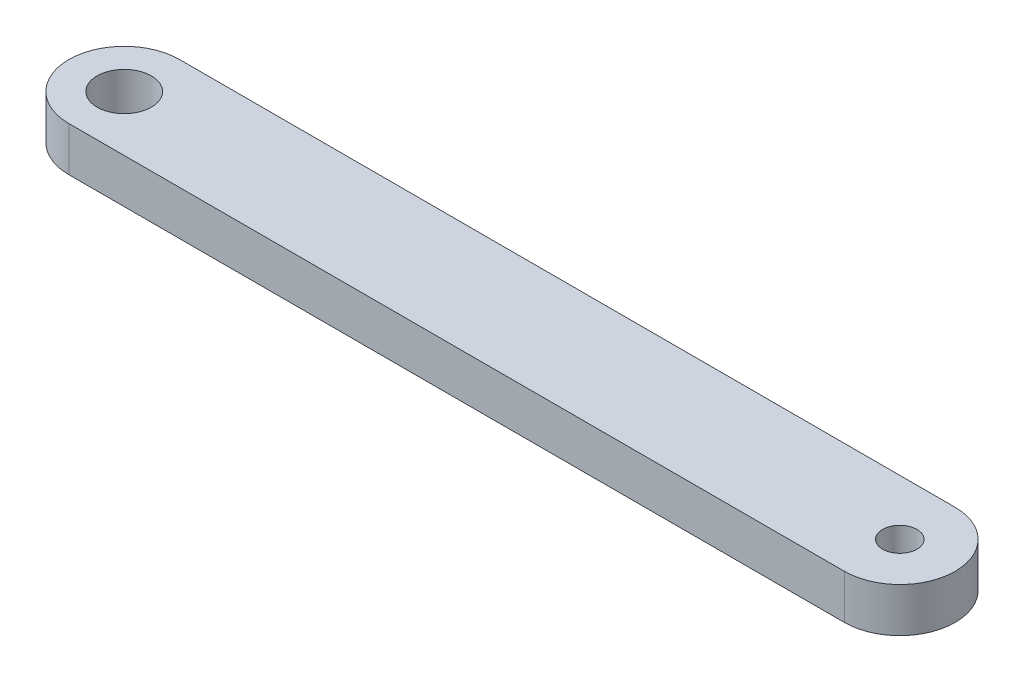
ISO-10303-21;
HEADER;
FILE_DESCRIPTION(('STEP AP214'),'2;1');
FILE_NAME('part.step','',(''),(''),'','','');
FILE_SCHEMA(('AUTOMOTIVE_DESIGN { 1 0 10303 214 1 1 1 1 }'));
ENDSEC;
DATA;
#1=APPLICATION_CONTEXT('core data for automotive mechanical design processes');
#2=APPLICATION_PROTOCOL_DEFINITION('international standard','automotive_design',2000,#1);
#3=PRODUCT_CONTEXT('',#1,'mechanical');
#4=PRODUCT('Part','Part','',(#3));
#5=PRODUCT_RELATED_PRODUCT_CATEGORY('part','',(#4));
#6=PRODUCT_DEFINITION_FORMATION('','',#4);
#7=PRODUCT_DEFINITION_CONTEXT('part definition',#1,'design');
#8=PRODUCT_DEFINITION('design','',#6,#7);
#9=PRODUCT_DEFINITION_SHAPE('','',#8);
#10=(LENGTH_UNIT() NAMED_UNIT(*) SI_UNIT(.MILLI.,.METRE.));
#11=(NAMED_UNIT(*) PLANE_ANGLE_UNIT() SI_UNIT($,.RADIAN.));
#12=(NAMED_UNIT(*) SI_UNIT($,.STERADIAN.) SOLID_ANGLE_UNIT());
#13=UNCERTAINTY_MEASURE_WITH_UNIT(LENGTH_MEASURE(1.E-05),#10,'distance_accuracy_value','');
#14=(GEOMETRIC_REPRESENTATION_CONTEXT(3) GLOBAL_UNCERTAINTY_ASSIGNED_CONTEXT((#13)) GLOBAL_UNIT_ASSIGNED_CONTEXT((#10,
#11,#12)) REPRESENTATION_CONTEXT('',''));
#15=CARTESIAN_POINT('',(0.,0.,0.));
#16=DIRECTION('',(0.,0.,1.));
#17=DIRECTION('',(1.,0.,0.));
#18=AXIS2_PLACEMENT_3D('',#15,#16,#17);
#19=CARTESIAN_POINT('',(0.,4.,0.));
#20=DIRECTION('',(0.,1.,0.));
#21=DIRECTION('',(0.,0.,1.));
#22=AXIS2_PLACEMENT_3D('',#19,#20,#21);
#23=PLANE('',#22);
#24=CARTESIAN_POINT('',(-70.,4.,0.));
#25=DIRECTION('',(0.,1.,0.));
#26=DIRECTION('',(0.,0.,1.));
#27=AXIS2_PLACEMENT_3D('',#24,#25,#26);
#28=CIRCLE('',#27,2.45);
#29=CARTESIAN_POINT('',(-70.,4.,2.45000000000001));
#30=VERTEX_POINT('',#29);
#31=EDGE_CURVE('E112',#30,#30,#28,.T.);
#32=ORIENTED_EDGE('',*,*,#31,.F.);
#33=EDGE_LOOP('',(#32));
#34=FACE_BOUND('',#33,.T.);
#35=CARTESIAN_POINT('',(0.,4.,0.));
#36=DIRECTION('',(0.,1.,0.));
#37=DIRECTION('',(0.,0.,1.));
#38=AXIS2_PLACEMENT_3D('',#35,#36,#37);
#39=CIRCLE('',#38,5.);
#40=CARTESIAN_POINT('',(0.,4.,5.));
#41=VERTEX_POINT('',#40);
#42=CARTESIAN_POINT('',(0.,4.,-5.));
#43=VERTEX_POINT('',#42);
#44=EDGE_CURVE('E92',#41,#43,#39,.T.);
#45=ORIENTED_EDGE('',*,*,#44,.T.);
#46=DIRECTION('',(-1.,0.,0.));
#47=VECTOR('',#46,1.);
#48=CARTESIAN_POINT('',(0.,4.,-5.));
#49=LINE('',#48,#47);
#50=CARTESIAN_POINT('',(-70.,4.,-4.99999999999999));
#51=VERTEX_POINT('',#50);
#52=EDGE_CURVE('E87',#43,#51,#49,.T.);
#53=ORIENTED_EDGE('',*,*,#52,.T.);
#54=CARTESIAN_POINT('',(-70.,4.,0.));
#55=DIRECTION('',(0.,1.,0.));
#56=DIRECTION('',(0.,0.,1.));
#57=AXIS2_PLACEMENT_3D('',#54,#55,#56);
#58=CIRCLE('',#57,5.);
#59=CARTESIAN_POINT('',(-70.,4.,5.00000000000001));
#60=VERTEX_POINT('',#59);
#61=EDGE_CURVE('E90',#51,#60,#58,.T.);
#62=ORIENTED_EDGE('',*,*,#61,.T.);
#63=DIRECTION('',(1.,0.,0.));
#64=VECTOR('',#63,1.);
#65=CARTESIAN_POINT('',(0.,4.,5.));
#66=LINE('',#65,#64);
#67=EDGE_CURVE('E57',#60,#41,#66,.T.);
#68=ORIENTED_EDGE('',*,*,#67,.T.);
#69=EDGE_LOOP('',(#45,#53,#62,#68));
#70=FACE_BOUND('',#69,.T.);
#71=CARTESIAN_POINT('',(0.,4.,0.));
#72=DIRECTION('',(0.,1.,0.));
#73=DIRECTION('',(0.,0.,1.));
#74=AXIS2_PLACEMENT_3D('',#71,#72,#73);
#75=CIRCLE('',#74,1.55);
#76=CARTESIAN_POINT('',(0.,4.,1.55));
#77=VERTEX_POINT('',#76);
#78=EDGE_CURVE('E134',#77,#77,#75,.T.);
#79=ORIENTED_EDGE('',*,*,#78,.F.);
#80=EDGE_LOOP('',(#79));
#81=FACE_BOUND('',#80,.T.);
#82=ADVANCED_FACE('F39',(#34,#70,#81),#23,.T.);
#83=CARTESIAN_POINT('',(0.,0.,0.));
#84=DIRECTION('',(0.,1.,0.));
#85=DIRECTION('',(0.,0.,1.));
#86=AXIS2_PLACEMENT_3D('',#83,#84,#85);
#87=PLANE('',#86);
#88=CARTESIAN_POINT('',(0.,0.,0.));
#89=DIRECTION('',(0.,1.,0.));
#90=DIRECTION('',(0.,0.,1.));
#91=AXIS2_PLACEMENT_3D('',#88,#89,#90);
#92=CIRCLE('',#91,5.);
#93=CARTESIAN_POINT('',(0.,0.,5.));
#94=VERTEX_POINT('',#93);
#95=CARTESIAN_POINT('',(0.,0.,-5.));
#96=VERTEX_POINT('',#95);
#97=EDGE_CURVE('E108',#94,#96,#92,.T.);
#98=ORIENTED_EDGE('',*,*,#97,.F.);
#99=DIRECTION('',(1.,0.,0.));
#100=VECTOR('',#99,1.);
#101=CARTESIAN_POINT('',(0.,0.,5.));
#102=LINE('',#101,#100);
#103=CARTESIAN_POINT('',(-70.,0.,5.00000000000001));
#104=VERTEX_POINT('',#103);
#105=EDGE_CURVE('E80',#104,#94,#102,.T.);
#106=ORIENTED_EDGE('',*,*,#105,.F.);
#107=CARTESIAN_POINT('',(-70.,0.,0.));
#108=DIRECTION('',(0.,1.,0.));
#109=DIRECTION('',(0.,0.,1.));
#110=AXIS2_PLACEMENT_3D('',#107,#108,#109);
#111=CIRCLE('',#110,5.);
#112=CARTESIAN_POINT('',(-70.,0.,-4.99999999999999));
#113=VERTEX_POINT('',#112);
#114=EDGE_CURVE('E74',#113,#104,#111,.T.);
#115=ORIENTED_EDGE('',*,*,#114,.F.);
#116=DIRECTION('',(-1.,0.,0.));
#117=VECTOR('',#116,1.);
#118=CARTESIAN_POINT('',(0.,0.,-5.));
#119=LINE('',#118,#117);
#120=EDGE_CURVE('E97',#96,#113,#119,.T.);
#121=ORIENTED_EDGE('',*,*,#120,.F.);
#122=EDGE_LOOP('',(#98,#106,#115,#121));
#123=FACE_BOUND('',#122,.T.);
#124=CARTESIAN_POINT('',(-70.,0.,0.));
#125=DIRECTION('',(0.,1.,0.));
#126=DIRECTION('',(0.,0.,1.));
#127=AXIS2_PLACEMENT_3D('',#124,#125,#126);
#128=CIRCLE('',#127,2.45);
#129=CARTESIAN_POINT('',(-70.,0.,2.45000000000001));
#130=VERTEX_POINT('',#129);
#131=EDGE_CURVE('E130',#130,#130,#128,.T.);
#132=ORIENTED_EDGE('',*,*,#131,.T.);
#133=EDGE_LOOP('',(#132));
#134=FACE_BOUND('',#133,.T.);
#135=CARTESIAN_POINT('',(0.,0.,0.));
#136=DIRECTION('',(0.,1.,0.));
#137=DIRECTION('',(0.,0.,1.));
#138=AXIS2_PLACEMENT_3D('',#135,#136,#137);
#139=CIRCLE('',#138,1.55);
#140=CARTESIAN_POINT('',(0.,0.,1.55));
#141=VERTEX_POINT('',#140);
#142=EDGE_CURVE('E138',#141,#141,#139,.T.);
#143=ORIENTED_EDGE('',*,*,#142,.T.);
#144=EDGE_LOOP('',(#143));
#145=FACE_BOUND('',#144,.T.);
#146=ADVANCED_FACE('F125',(#123,#134,#145),#87,.F.);
#147=CARTESIAN_POINT('',(0.,4.,0.));
#148=DIRECTION('',(0.,-1.,0.));
#149=DIRECTION('',(0.,0.,-1.));
#150=AXIS2_PLACEMENT_3D('',#147,#148,#149);
#151=CYLINDRICAL_SURFACE('',#150,5.);
#152=ORIENTED_EDGE('',*,*,#97,.T.);
#153=DIRECTION('',(0.,-1.,0.));
#154=VECTOR('',#153,1.);
#155=CARTESIAN_POINT('',(0.,4.,-5.));
#156=LINE('',#155,#154);
#157=EDGE_CURVE('E11',#43,#96,#156,.T.);
#158=ORIENTED_EDGE('',*,*,#157,.F.);
#159=ORIENTED_EDGE('',*,*,#44,.F.);
#160=DIRECTION('',(0.,-1.,0.));
#161=VECTOR('',#160,1.);
#162=CARTESIAN_POINT('',(0.,4.,5.));
#163=LINE('',#162,#161);
#164=EDGE_CURVE('E104',#41,#94,#163,.T.);
#165=ORIENTED_EDGE('',*,*,#164,.T.);
#166=EDGE_LOOP('',(#152,#158,#159,#165));
#167=FACE_BOUND('',#166,.T.);
#168=ADVANCED_FACE('F41',(#167),#151,.T.);
#169=CARTESIAN_POINT('',(0.,4.,-5.));
#170=DIRECTION('',(0.,0.,1.));
#171=DIRECTION('',(1.,0.,0.));
#172=AXIS2_PLACEMENT_3D('',#169,#170,#171);
#173=PLANE('',#172);
#174=ORIENTED_EDGE('',*,*,#120,.T.);
#175=DIRECTION('',(0.,-1.,0.));
#176=VECTOR('',#175,1.);
#177=CARTESIAN_POINT('',(-70.,4.,-4.99999999999999));
#178=LINE('',#177,#176);
#179=EDGE_CURVE('E49',#51,#113,#178,.T.);
#180=ORIENTED_EDGE('',*,*,#179,.F.);
#181=ORIENTED_EDGE('',*,*,#52,.F.);
#182=ORIENTED_EDGE('',*,*,#157,.T.);
#183=EDGE_LOOP('',(#174,#180,#181,#182));
#184=FACE_BOUND('',#183,.T.);
#185=ADVANCED_FACE('F96',(#184),#173,.F.);
#186=CARTESIAN_POINT('',(-70.,4.,0.));
#187=DIRECTION('',(0.,-1.,0.));
#188=DIRECTION('',(0.,0.,-1.));
#189=AXIS2_PLACEMENT_3D('',#186,#187,#188);
#190=CYLINDRICAL_SURFACE('',#189,5.);
#191=ORIENTED_EDGE('',*,*,#114,.T.);
#192=DIRECTION('',(0.,-1.,0.));
#193=VECTOR('',#192,1.);
#194=CARTESIAN_POINT('',(-70.,4.,5.00000000000001));
#195=LINE('',#194,#193);
#196=EDGE_CURVE('E99',#60,#104,#195,.T.);
#197=ORIENTED_EDGE('',*,*,#196,.F.);
#198=ORIENTED_EDGE('',*,*,#61,.F.);
#199=ORIENTED_EDGE('',*,*,#179,.T.);
#200=EDGE_LOOP('',(#191,#197,#198,#199));
#201=FACE_BOUND('',#200,.T.);
#202=ADVANCED_FACE('F100',(#201),#190,.T.);
#203=CARTESIAN_POINT('',(0.,4.,5.));
#204=DIRECTION('',(0.,0.,-1.));
#205=DIRECTION('',(-1.,0.,0.));
#206=AXIS2_PLACEMENT_3D('',#203,#204,#205);
#207=PLANE('',#206);
#208=ORIENTED_EDGE('',*,*,#105,.T.);
#209=ORIENTED_EDGE('',*,*,#164,.F.);
#210=ORIENTED_EDGE('',*,*,#67,.F.);
#211=ORIENTED_EDGE('',*,*,#196,.T.);
#212=EDGE_LOOP('',(#208,#209,#210,#211));
#213=FACE_BOUND('',#212,.T.);
#214=ADVANCED_FACE('F122',(#213),#207,.F.);
#215=CARTESIAN_POINT('',(-70.,4.,0.));
#216=DIRECTION('',(0.,-1.,0.));
#217=DIRECTION('',(0.,0.,-1.));
#218=AXIS2_PLACEMENT_3D('',#215,#216,#217);
#219=CYLINDRICAL_SURFACE('',#218,2.45);
#220=ORIENTED_EDGE('',*,*,#31,.T.);
#221=EDGE_LOOP('',(#220));
#222=FACE_BOUND('',#221,.T.);
#223=ORIENTED_EDGE('',*,*,#131,.F.);
#224=EDGE_LOOP('',(#223));
#225=FACE_BOUND('',#224,.T.);
#226=ADVANCED_FACE('F157',(#222,#225),#219,.F.);
#227=CARTESIAN_POINT('',(0.,4.,0.));
#228=DIRECTION('',(0.,-1.,0.));
#229=DIRECTION('',(0.,0.,-1.));
#230=AXIS2_PLACEMENT_3D('',#227,#228,#229);
#231=CYLINDRICAL_SURFACE('',#230,1.55);
#232=ORIENTED_EDGE('',*,*,#78,.T.);
#233=EDGE_LOOP('',(#232));
#234=FACE_BOUND('',#233,.T.);
#235=ORIENTED_EDGE('',*,*,#142,.F.);
#236=EDGE_LOOP('',(#235));
#237=FACE_BOUND('',#236,.T.);
#238=ADVANCED_FACE('F146',(#234,#237),#231,.F.);
#239=CLOSED_SHELL('',(#82,#146,#168,#185,#202,#214,#226,#238));
#240=MANIFOLD_SOLID_BREP('B2',#239);
#241=ADVANCED_BREP_SHAPE_REPRESENTATION('',(#18,#240),#14);
#242=SHAPE_DEFINITION_REPRESENTATION(#9,#241);
ENDSEC;
END-ISO-10303-21;
